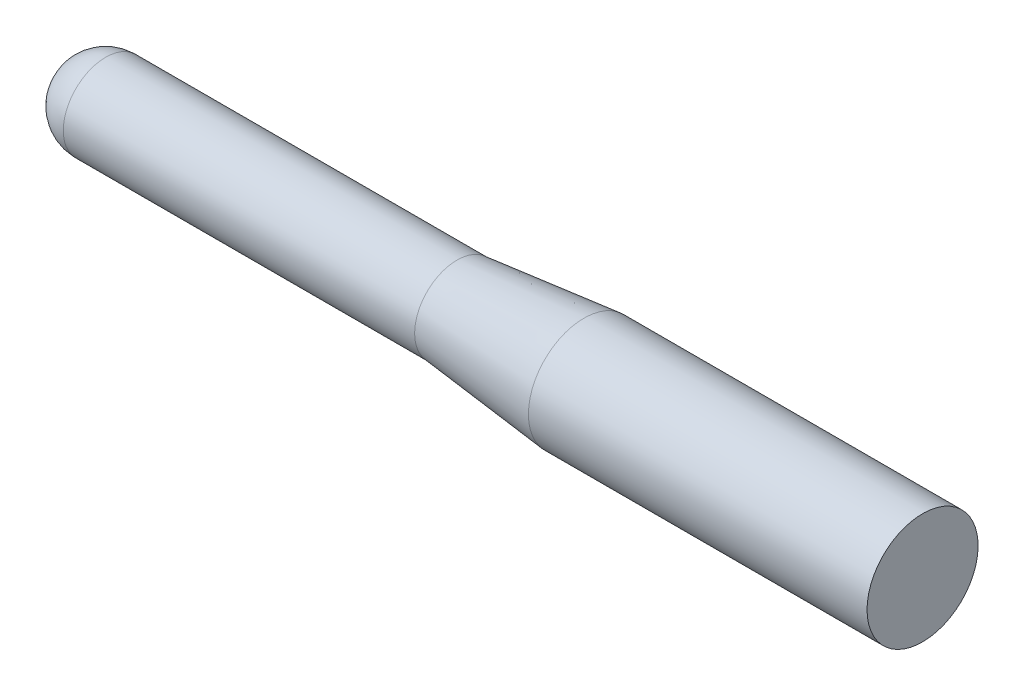
ISO-10303-21;
HEADER;
FILE_DESCRIPTION(('STEP AP214'),'2;1');
FILE_NAME('part.step','',(''),(''),'','','');
FILE_SCHEMA(('AUTOMOTIVE_DESIGN { 1 0 10303 214 1 1 1 1 }'));
ENDSEC;
DATA;
#1=APPLICATION_CONTEXT('core data for automotive mechanical design processes');
#2=APPLICATION_PROTOCOL_DEFINITION('international standard','automotive_design',2000,#1);
#3=PRODUCT_CONTEXT('',#1,'mechanical');
#4=PRODUCT('Part','Part','',(#3));
#5=PRODUCT_RELATED_PRODUCT_CATEGORY('part','',(#4));
#6=PRODUCT_DEFINITION_FORMATION('','',#4);
#7=PRODUCT_DEFINITION_CONTEXT('part definition',#1,'design');
#8=PRODUCT_DEFINITION('design','',#6,#7);
#9=PRODUCT_DEFINITION_SHAPE('','',#8);
#10=(LENGTH_UNIT() NAMED_UNIT(*) SI_UNIT(.MILLI.,.METRE.));
#11=(NAMED_UNIT(*) PLANE_ANGLE_UNIT() SI_UNIT($,.RADIAN.));
#12=(NAMED_UNIT(*) SI_UNIT($,.STERADIAN.) SOLID_ANGLE_UNIT());
#13=UNCERTAINTY_MEASURE_WITH_UNIT(LENGTH_MEASURE(1.E-05),#10,'distance_accuracy_value','');
#14=(GEOMETRIC_REPRESENTATION_CONTEXT(3) GLOBAL_UNCERTAINTY_ASSIGNED_CONTEXT((#13)) GLOBAL_UNIT_ASSIGNED_CONTEXT((#10,
#11,#12)) REPRESENTATION_CONTEXT('',''));
#15=CARTESIAN_POINT('',(0.,0.,0.));
#16=DIRECTION('',(0.,0.,1.));
#17=DIRECTION('',(1.,0.,0.));
#18=AXIS2_PLACEMENT_3D('',#15,#16,#17);
#19=CARTESIAN_POINT('',(12.7,0.,0.));
#20=DIRECTION('',(-1.,0.,0.));
#21=DIRECTION('',(0.,1.,0.));
#22=AXIS2_PLACEMENT_3D('',#19,#20,#21);
#23=SPHERICAL_SURFACE('',#22,12.7);
#24=CARTESIAN_POINT('',(12.7,0.,0.));
#25=DIRECTION('',(-1.,0.,0.));
#26=DIRECTION('',(0.,0.,1.));
#27=AXIS2_PLACEMENT_3D('',#24,#25,#26);
#28=CIRCLE('',#27,12.7);
#29=CARTESIAN_POINT('',(12.7,0.,12.7));
#30=VERTEX_POINT('',#29);
#31=EDGE_CURVE('E60',#30,#30,#28,.T.);
#32=ORIENTED_EDGE('',*,*,#31,.T.);
#33=EDGE_LOOP('',(#32));
#34=FACE_BOUND('',#33,.T.);
#35=ADVANCED_FACE('F43',(#34),#23,.T.);
#36=CARTESIAN_POINT('',(257.810003034716,16.6622899516701,0.));
#37=DIRECTION('',(-1.,0.,0.));
#38=DIRECTION('',(0.,0.,1.));
#39=AXIS2_PLACEMENT_3D('',#36,#37,#38);
#40=PLANE('',#39);
#41=CARTESIAN_POINT('',(257.810003034716,0.,0.));
#42=DIRECTION('',(-1.,0.,0.));
#43=DIRECTION('',(0.,0.,1.));
#44=AXIS2_PLACEMENT_3D('',#41,#42,#43);
#45=CIRCLE('',#44,16.6622899516701);
#46=CARTESIAN_POINT('',(257.810003034716,0.,16.6622899516701));
#47=VERTEX_POINT('',#46);
#48=EDGE_CURVE('E10',#47,#47,#45,.T.);
#49=ORIENTED_EDGE('',*,*,#48,.F.);
#50=EDGE_LOOP('',(#49));
#51=FACE_BOUND('',#50,.T.);
#52=ADVANCED_FACE('F81',(#51),#40,.F.);
#53=CARTESIAN_POINT('',(0.,0.,0.));
#54=DIRECTION('',(-1.,0.,0.));
#55=DIRECTION('',(0.,0.,1.));
#56=AXIS2_PLACEMENT_3D('',#53,#54,#55);
#57=CYLINDRICAL_SURFACE('',#56,16.6622899516701);
#58=CARTESIAN_POINT('',(156.210003034716,0.,0.));
#59=DIRECTION('',(-1.,0.,0.));
#60=DIRECTION('',(0.,0.,1.));
#61=AXIS2_PLACEMENT_3D('',#58,#59,#60);
#62=CIRCLE('',#61,16.6622899516701);
#63=CARTESIAN_POINT('',(156.210003034716,0.,16.6622899516701));
#64=VERTEX_POINT('',#63);
#65=EDGE_CURVE('E50',#64,#64,#62,.T.);
#66=ORIENTED_EDGE('',*,*,#65,.F.);
#67=EDGE_LOOP('',(#66));
#68=FACE_BOUND('',#67,.T.);
#69=ORIENTED_EDGE('',*,*,#48,.T.);
#70=EDGE_LOOP('',(#69));
#71=FACE_BOUND('',#70,.T.);
#72=ADVANCED_FACE('F76',(#68,#71),#57,.T.);
#73=CARTESIAN_POINT('',(156.210003034716,0.,0.));
#74=DIRECTION('',(1.,0.,0.));
#75=DIRECTION('',(0.,0.,-1.));
#76=AXIS2_PLACEMENT_3D('',#73,#74,#75);
#77=CONICAL_SURFACE('',#76,16.6622899516701,0.103624594300266);
#78=CARTESIAN_POINT('',(118.11,0.,0.));
#79=DIRECTION('',(-1.,0.,0.));
#80=DIRECTION('',(0.,0.,1.));
#81=AXIS2_PLACEMENT_3D('',#78,#79,#80);
#82=CIRCLE('',#81,12.7);
#83=CARTESIAN_POINT('',(118.11,0.,12.7));
#84=VERTEX_POINT('',#83);
#85=EDGE_CURVE('E55',#84,#84,#82,.T.);
#86=ORIENTED_EDGE('',*,*,#85,.F.);
#87=EDGE_LOOP('',(#86));
#88=FACE_BOUND('',#87,.T.);
#89=ORIENTED_EDGE('',*,*,#65,.T.);
#90=EDGE_LOOP('',(#89));
#91=FACE_BOUND('',#90,.T.);
#92=ADVANCED_FACE('F71',(#88,#91),#77,.T.);
#93=CARTESIAN_POINT('',(0.,0.,0.));
#94=DIRECTION('',(-1.,0.,0.));
#95=DIRECTION('',(0.,0.,1.));
#96=AXIS2_PLACEMENT_3D('',#93,#94,#95);
#97=CYLINDRICAL_SURFACE('',#96,12.7);
#98=ORIENTED_EDGE('',*,*,#31,.F.);
#99=EDGE_LOOP('',(#98));
#100=FACE_BOUND('',#99,.T.);
#101=ORIENTED_EDGE('',*,*,#85,.T.);
#102=EDGE_LOOP('',(#101));
#103=FACE_BOUND('',#102,.T.);
#104=ADVANCED_FACE('F68',(#100,#103),#97,.T.);
#105=CLOSED_SHELL('',(#35,#52,#72,#92,#104));
#106=MANIFOLD_SOLID_BREP('B2',#105);
#107=ADVANCED_BREP_SHAPE_REPRESENTATION('',(#18,#106),#14);
#108=SHAPE_DEFINITION_REPRESENTATION(#9,#107);
ENDSEC;
END-ISO-10303-21;
